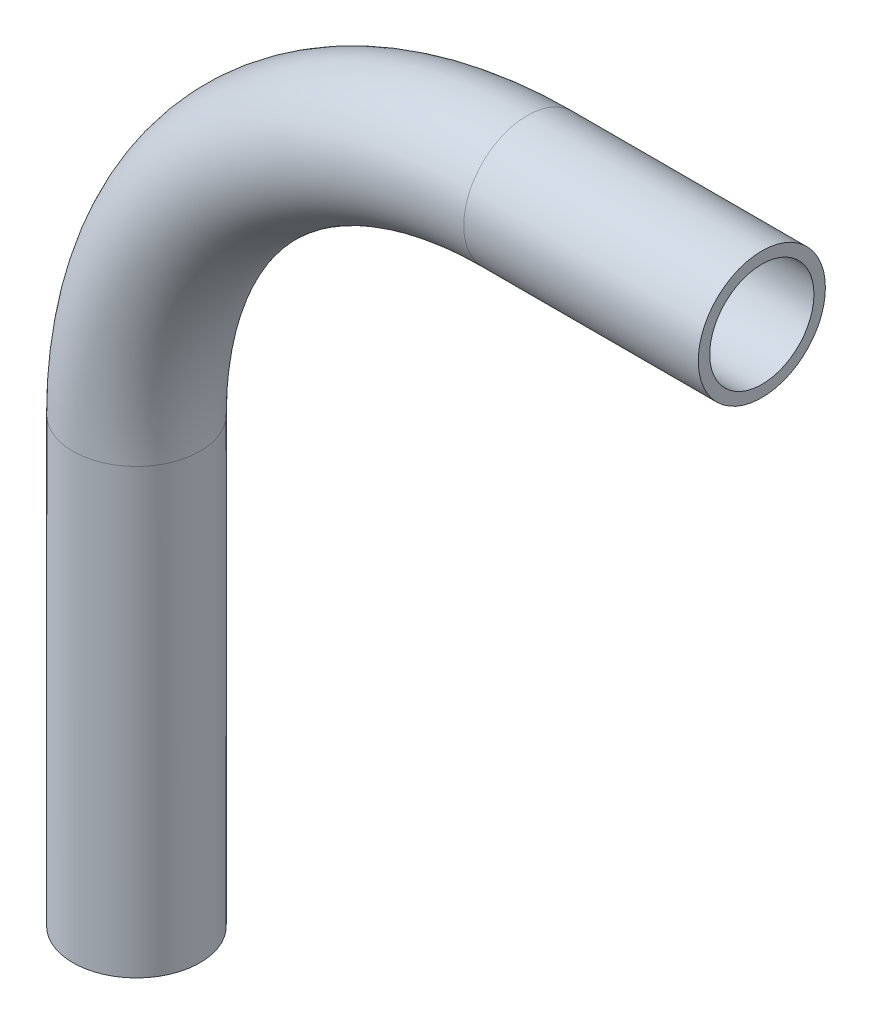
ISO-10303-21;
HEADER;
FILE_DESCRIPTION(('STEP AP214'),'2;1');
FILE_NAME('part.step','',(''),(''),'','','');
FILE_SCHEMA(('AUTOMOTIVE_DESIGN { 1 0 10303 214 1 1 1 1 }'));
ENDSEC;
DATA;
#1=APPLICATION_CONTEXT('core data for automotive mechanical design processes');
#2=APPLICATION_PROTOCOL_DEFINITION('international standard','automotive_design',2000,#1);
#3=PRODUCT_CONTEXT('',#1,'mechanical');
#4=PRODUCT('Part','Part','',(#3));
#5=PRODUCT_RELATED_PRODUCT_CATEGORY('part','',(#4));
#6=PRODUCT_DEFINITION_FORMATION('','',#4);
#7=PRODUCT_DEFINITION_CONTEXT('part definition',#1,'design');
#8=PRODUCT_DEFINITION('design','',#6,#7);
#9=PRODUCT_DEFINITION_SHAPE('','',#8);
#10=(LENGTH_UNIT() NAMED_UNIT(*) SI_UNIT(.MILLI.,.METRE.));
#11=(NAMED_UNIT(*) PLANE_ANGLE_UNIT() SI_UNIT($,.RADIAN.));
#12=(NAMED_UNIT(*) SI_UNIT($,.STERADIAN.) SOLID_ANGLE_UNIT());
#13=UNCERTAINTY_MEASURE_WITH_UNIT(LENGTH_MEASURE(1.E-05),#10,'distance_accuracy_value','');
#14=(GEOMETRIC_REPRESENTATION_CONTEXT(3) GLOBAL_UNCERTAINTY_ASSIGNED_CONTEXT((#13)) GLOBAL_UNIT_ASSIGNED_CONTEXT((#10,
#11,#12)) REPRESENTATION_CONTEXT('',''));
#15=CARTESIAN_POINT('',(0.,0.,0.));
#16=DIRECTION('',(0.,0.,1.));
#17=DIRECTION('',(1.,0.,0.));
#18=AXIS2_PLACEMENT_3D('',#15,#16,#17);
#19=CARTESIAN_POINT('',(-6.07620592458876E-13,-50.8,0.));
#20=DIRECTION('',(0.,1.,0.));
#21=DIRECTION('',(-1.,0.,0.));
#22=AXIS2_PLACEMENT_3D('',#19,#20,#21);
#23=CYLINDRICAL_SURFACE('',#22,3.8735);
#24=CARTESIAN_POINT('',(-2.84494650060196E-13,-23.8125000000001,0.));
#25=DIRECTION('',(0.,1.,0.));
#26=DIRECTION('',(0.,0.,-1.));
#27=AXIS2_PLACEMENT_3D('',#24,#25,#26);
#28=CIRCLE('',#27,3.8735);
#29=CARTESIAN_POINT('',(-3.87350000000028,-23.8125,0.));
#30=VERTEX_POINT('',#29);
#31=EDGE_CURVE('E90',#30,#30,#28,.T.);
#32=ORIENTED_EDGE('',*,*,#31,.F.);
#33=EDGE_LOOP('',(#32));
#34=FACE_BOUND('',#33,.T.);
#35=CARTESIAN_POINT('',(-6.07620592458876E-13,-50.8,0.));
#36=DIRECTION('',(0.,1.,0.));
#37=DIRECTION('',(0.,0.,-1.));
#38=AXIS2_PLACEMENT_3D('',#35,#36,#37);
#39=CIRCLE('',#38,3.8735);
#40=CARTESIAN_POINT('',(-6.07620592458876E-13,-50.8,-3.8735));
#41=VERTEX_POINT('',#40);
#42=EDGE_CURVE('E55',#41,#41,#39,.T.);
#43=ORIENTED_EDGE('',*,*,#42,.T.);
#44=EDGE_LOOP('',(#43));
#45=FACE_BOUND('',#44,.T.);
#46=ADVANCED_FACE('F39',(#34,#45),#23,.T.);
#47=CARTESIAN_POINT('',(23.8124999999997,-23.8125000000004,0.));
#48=DIRECTION('',(0.,0.,-1.));
#49=DIRECTION('',(-1.,0.,0.));
#50=AXIS2_PLACEMENT_3D('',#47,#48,#49);
#51=TOROIDAL_SURFACE('',#50,23.8125,3.8735);
#52=CARTESIAN_POINT('',(23.8125000000001,-3.74030180194451E-13,0.));
#53=DIRECTION('',(1.,0.,0.));
#54=DIRECTION('',(0.,0.,-1.));
#55=AXIS2_PLACEMENT_3D('',#52,#53,#54);
#56=CIRCLE('',#55,3.8735);
#57=CARTESIAN_POINT('',(23.8125000000002,3.87349999999963,0.));
#58=VERTEX_POINT('',#57);
#59=EDGE_CURVE('E43',#58,#58,#56,.T.);
#60=CARTESIAN_POINT('',(23.8124999999997,-23.8125000000004,0.));
#61=DIRECTION('',(0.,0.,-1.));
#62=DIRECTION('',(-1.,0.,0.));
#63=AXIS2_PLACEMENT_3D('',#60,#61,#62);
#64=CIRCLE('',#63,27.686);
#65=EDGE_CURVE('',#30,#58,#64,.T.);
#66=ORIENTED_EDGE('',*,*,#31,.T.);
#67=ORIENTED_EDGE('',*,*,#59,.F.);
#68=ORIENTED_EDGE('',*,*,#65,.T.);
#69=ORIENTED_EDGE('',*,*,#65,.F.);
#70=EDGE_LOOP('',(#66,#68,#67,#69));
#71=FACE_BOUND('',#70,.T.);
#72=ADVANCED_FACE('F100',(#71),#51,.T.);
#73=CARTESIAN_POINT('',(23.8125000000001,-3.78169717762944E-13,0.));
#74=DIRECTION('',(1.,0.,0.));
#75=DIRECTION('',(0.,1.,0.));
#76=AXIS2_PLACEMENT_3D('',#73,#74,#75);
#77=CYLINDRICAL_SURFACE('',#76,3.8735);
#78=CARTESIAN_POINT('',(38.1,-6.02738596268335E-13,0.));
#79=DIRECTION('',(1.,0.,0.));
#80=DIRECTION('',(0.,0.,-1.));
#81=AXIS2_PLACEMENT_3D('',#78,#79,#80);
#82=CIRCLE('',#81,3.8735);
#83=CARTESIAN_POINT('',(38.1,-6.02738596268335E-13,-3.8735));
#84=VERTEX_POINT('',#83);
#85=EDGE_CURVE('E60',#84,#84,#82,.T.);
#86=ORIENTED_EDGE('',*,*,#85,.F.);
#87=EDGE_LOOP('',(#86));
#88=FACE_BOUND('',#87,.T.);
#89=ORIENTED_EDGE('',*,*,#59,.T.);
#90=EDGE_LOOP('',(#89));
#91=FACE_BOUND('',#90,.T.);
#92=ADVANCED_FACE('F41',(#88,#91),#77,.T.);
#93=CARTESIAN_POINT('',(-6.07620592458876E-13,-50.8,0.));
#94=DIRECTION('',(0.,1.,0.));
#95=DIRECTION('',(0.,0.,-1.));
#96=AXIS2_PLACEMENT_3D('',#93,#94,#95);
#97=PLANE('',#96);
#98=CARTESIAN_POINT('',(-6.07620592458876E-13,-50.8,0.));
#99=DIRECTION('',(0.,1.,0.));
#100=DIRECTION('',(0.,0.,-1.));
#101=AXIS2_PLACEMENT_3D('',#98,#99,#100);
#102=CIRCLE('',#101,3.175);
#103=CARTESIAN_POINT('',(-6.07620592458876E-13,-50.8,-3.175));
#104=VERTEX_POINT('',#103);
#105=EDGE_CURVE('E83',#104,#104,#102,.F.);
#106=ORIENTED_EDGE('',*,*,#105,.F.);
#107=EDGE_LOOP('',(#106));
#108=FACE_BOUND('',#107,.T.);
#109=ORIENTED_EDGE('',*,*,#42,.F.);
#110=EDGE_LOOP('',(#109));
#111=FACE_BOUND('',#110,.T.);
#112=ADVANCED_FACE('F106',(#108,#111),#97,.F.);
#113=CARTESIAN_POINT('',(38.1,-6.02738596268335E-13,0.));
#114=DIRECTION('',(1.,0.,0.));
#115=DIRECTION('',(0.,0.,-1.));
#116=AXIS2_PLACEMENT_3D('',#113,#114,#115);
#117=PLANE('',#116);
#118=CARTESIAN_POINT('',(38.1,-6.02738596268335E-13,0.));
#119=DIRECTION('',(1.,0.,0.));
#120=DIRECTION('',(0.,0.,-1.));
#121=AXIS2_PLACEMENT_3D('',#118,#119,#120);
#122=CIRCLE('',#121,3.175);
#123=CARTESIAN_POINT('',(38.1,-6.02738596268335E-13,-3.175));
#124=VERTEX_POINT('',#123);
#125=EDGE_CURVE('E11',#124,#124,#122,.F.);
#126=ORIENTED_EDGE('',*,*,#125,.T.);
#127=EDGE_LOOP('',(#126));
#128=FACE_BOUND('',#127,.T.);
#129=ORIENTED_EDGE('',*,*,#85,.T.);
#130=EDGE_LOOP('',(#129));
#131=FACE_BOUND('',#130,.T.);
#132=ADVANCED_FACE('F67',(#128,#131),#117,.T.);
#133=CARTESIAN_POINT('',(-6.07620592458876E-13,-50.8,0.));
#134=DIRECTION('',(0.,1.,0.));
#135=DIRECTION('',(-1.,0.,0.));
#136=AXIS2_PLACEMENT_3D('',#133,#134,#135);
#137=CYLINDRICAL_SURFACE('',#136,3.175);
#138=CARTESIAN_POINT('',(-2.84494650060196E-13,-23.8125000000001,0.));
#139=DIRECTION('',(0.,1.,0.));
#140=DIRECTION('',(0.,0.,-1.));
#141=AXIS2_PLACEMENT_3D('',#138,#139,#140);
#142=CIRCLE('',#141,3.175);
#143=CARTESIAN_POINT('',(-3.17500000000028,-23.8125000000001,0.));
#144=VERTEX_POINT('',#143);
#145=EDGE_CURVE('E79',#144,#144,#142,.F.);
#146=ORIENTED_EDGE('',*,*,#145,.F.);
#147=EDGE_LOOP('',(#146));
#148=FACE_BOUND('',#147,.T.);
#149=ORIENTED_EDGE('',*,*,#105,.T.);
#150=EDGE_LOOP('',(#149));
#151=FACE_BOUND('',#150,.T.);
#152=ADVANCED_FACE('F114',(#148,#151),#137,.F.);
#153=CARTESIAN_POINT('',(23.8124999999997,-23.8125000000004,0.));
#154=DIRECTION('',(0.,0.,-1.));
#155=DIRECTION('',(-1.,0.,0.));
#156=AXIS2_PLACEMENT_3D('',#153,#154,#155);
#157=TOROIDAL_SURFACE('',#156,23.8125,3.175);
#158=CARTESIAN_POINT('',(23.8125000000001,-3.74030180194451E-13,0.));
#159=DIRECTION('',(1.,0.,0.));
#160=DIRECTION('',(0.,0.,-1.));
#161=AXIS2_PLACEMENT_3D('',#158,#159,#160);
#162=CIRCLE('',#161,3.175);
#163=CARTESIAN_POINT('',(23.8125000000001,3.17499999999963,0.));
#164=VERTEX_POINT('',#163);
#165=EDGE_CURVE('E49',#164,#164,#162,.F.);
#166=CARTESIAN_POINT('',(23.8124999999997,-23.8125000000004,0.));
#167=DIRECTION('',(0.,0.,-1.));
#168=DIRECTION('',(-1.,0.,0.));
#169=AXIS2_PLACEMENT_3D('',#166,#167,#168);
#170=CIRCLE('',#169,26.9875);
#171=EDGE_CURVE('',#144,#164,#170,.T.);
#172=ORIENTED_EDGE('',*,*,#145,.T.);
#173=ORIENTED_EDGE('',*,*,#165,.F.);
#174=ORIENTED_EDGE('',*,*,#171,.T.);
#175=ORIENTED_EDGE('',*,*,#171,.F.);
#176=EDGE_LOOP('',(#172,#174,#173,#175));
#177=FACE_BOUND('',#176,.T.);
#178=ADVANCED_FACE('F73',(#177),#157,.F.);
#179=CARTESIAN_POINT('',(23.8125000000001,-3.78169717762944E-13,0.));
#180=DIRECTION('',(1.,0.,0.));
#181=DIRECTION('',(0.,1.,0.));
#182=AXIS2_PLACEMENT_3D('',#179,#180,#181);
#183=CYLINDRICAL_SURFACE('',#182,3.175);
#184=ORIENTED_EDGE('',*,*,#125,.F.);
#185=EDGE_LOOP('',(#184));
#186=FACE_BOUND('',#185,.T.);
#187=ORIENTED_EDGE('',*,*,#165,.T.);
#188=EDGE_LOOP('',(#187));
#189=FACE_BOUND('',#188,.T.);
#190=ADVANCED_FACE('F70',(#186,#189),#183,.F.);
#191=CLOSED_SHELL('',(#46,#72,#92,#112,#132,#152,#178,#190));
#192=MANIFOLD_SOLID_BREP('B2',#191);
#193=ADVANCED_BREP_SHAPE_REPRESENTATION('',(#18,#192),#14);
#194=SHAPE_DEFINITION_REPRESENTATION(#9,#193);
ENDSEC;
END-ISO-10303-21;
